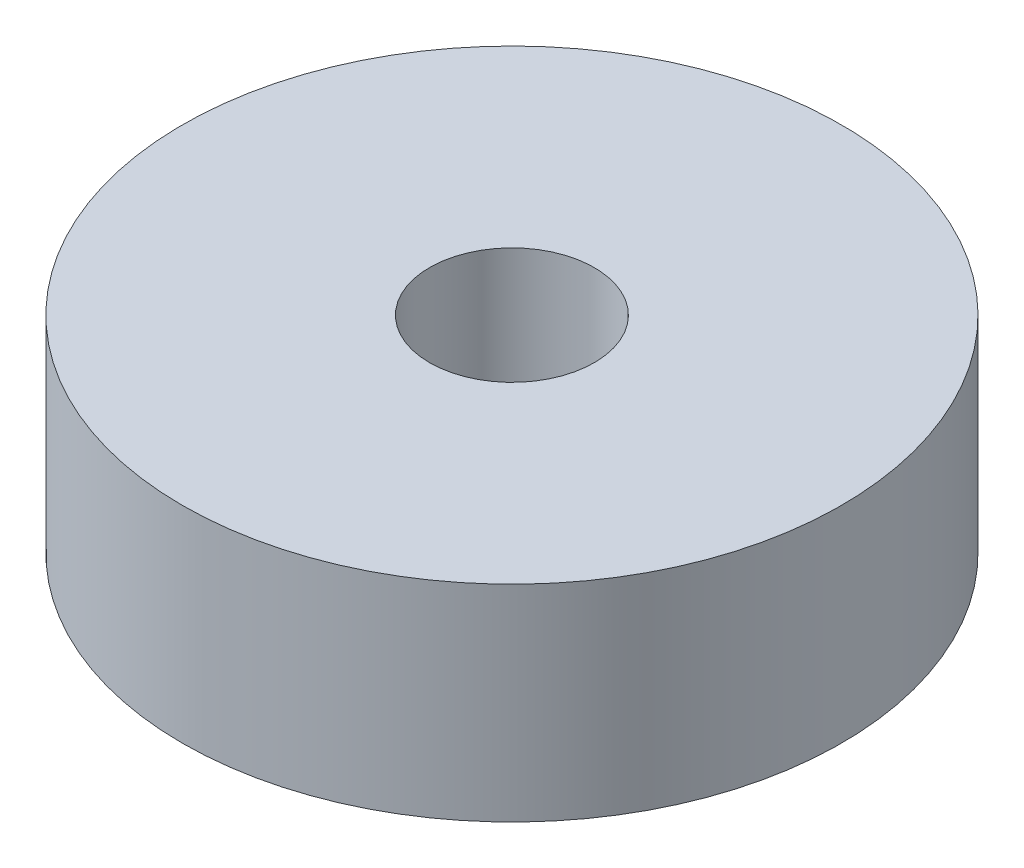
ISO-10303-21;
HEADER;
FILE_DESCRIPTION(('STEP AP214'),'2;1');
FILE_NAME('part.step','',(''),(''),'','','');
FILE_SCHEMA(('AUTOMOTIVE_DESIGN { 1 0 10303 214 1 1 1 1 }'));
ENDSEC;
DATA;
#1=APPLICATION_CONTEXT('core data for automotive mechanical design processes');
#2=APPLICATION_PROTOCOL_DEFINITION('international standard','automotive_design',2000,#1);
#3=PRODUCT_CONTEXT('',#1,'mechanical');
#4=PRODUCT('Part','Part','',(#3));
#5=PRODUCT_RELATED_PRODUCT_CATEGORY('part','',(#4));
#6=PRODUCT_DEFINITION_FORMATION('','',#4);
#7=PRODUCT_DEFINITION_CONTEXT('part definition',#1,'design');
#8=PRODUCT_DEFINITION('design','',#6,#7);
#9=PRODUCT_DEFINITION_SHAPE('','',#8);
#10=(LENGTH_UNIT() NAMED_UNIT(*) SI_UNIT(.MILLI.,.METRE.));
#11=(NAMED_UNIT(*) PLANE_ANGLE_UNIT() SI_UNIT($,.RADIAN.));
#12=(NAMED_UNIT(*) SI_UNIT($,.STERADIAN.) SOLID_ANGLE_UNIT());
#13=UNCERTAINTY_MEASURE_WITH_UNIT(LENGTH_MEASURE(1.E-05),#10,'distance_accuracy_value','');
#14=(GEOMETRIC_REPRESENTATION_CONTEXT(3) GLOBAL_UNCERTAINTY_ASSIGNED_CONTEXT((#13)) GLOBAL_UNIT_ASSIGNED_CONTEXT((#10,
#11,#12)) REPRESENTATION_CONTEXT('',''));
#15=CARTESIAN_POINT('',(0.,0.,0.));
#16=DIRECTION('',(0.,0.,1.));
#17=DIRECTION('',(1.,0.,0.));
#18=AXIS2_PLACEMENT_3D('',#15,#16,#17);
#19=CARTESIAN_POINT('',(0.,5.,0.));
#20=DIRECTION('',(0.,1.,0.));
#21=DIRECTION('',(0.,0.,1.));
#22=AXIS2_PLACEMENT_3D('',#19,#20,#21);
#23=PLANE('',#22);
#24=CARTESIAN_POINT('',(0.,5.,0.));
#25=DIRECTION('',(0.,1.,0.));
#26=DIRECTION('',(0.,0.,1.));
#27=AXIS2_PLACEMENT_3D('',#24,#25,#26);
#28=CIRCLE('',#27,8.);
#29=CARTESIAN_POINT('',(0.,5.,8.));
#30=VERTEX_POINT('',#29);
#31=EDGE_CURVE('E10',#30,#30,#28,.T.);
#32=ORIENTED_EDGE('',*,*,#31,.T.);
#33=EDGE_LOOP('',(#32));
#34=FACE_BOUND('',#33,.T.);
#35=CARTESIAN_POINT('',(0.,5.,0.));
#36=DIRECTION('',(0.,1.,0.));
#37=DIRECTION('',(0.,0.,1.));
#38=AXIS2_PLACEMENT_3D('',#35,#36,#37);
#39=CIRCLE('',#38,2.);
#40=CARTESIAN_POINT('',(0.,5.,2.));
#41=VERTEX_POINT('',#40);
#42=EDGE_CURVE('E43',#41,#41,#39,.T.);
#43=ORIENTED_EDGE('',*,*,#42,.F.);
#44=EDGE_LOOP('',(#43));
#45=FACE_BOUND('',#44,.T.);
#46=ADVANCED_FACE('F32',(#34,#45),#23,.T.);
#47=CARTESIAN_POINT('',(0.,0.,0.));
#48=DIRECTION('',(0.,1.,0.));
#49=DIRECTION('',(0.,0.,1.));
#50=AXIS2_PLACEMENT_3D('',#47,#48,#49);
#51=PLANE('',#50);
#52=CARTESIAN_POINT('',(0.,0.,0.));
#53=DIRECTION('',(0.,1.,0.));
#54=DIRECTION('',(0.,0.,1.));
#55=AXIS2_PLACEMENT_3D('',#52,#53,#54);
#56=CIRCLE('',#55,8.);
#57=CARTESIAN_POINT('',(0.,0.,8.));
#58=VERTEX_POINT('',#57);
#59=EDGE_CURVE('E36',#58,#58,#56,.T.);
#60=ORIENTED_EDGE('',*,*,#59,.F.);
#61=EDGE_LOOP('',(#60));
#62=FACE_BOUND('',#61,.T.);
#63=CARTESIAN_POINT('',(0.,0.,0.));
#64=DIRECTION('',(0.,1.,0.));
#65=DIRECTION('',(0.,0.,1.));
#66=AXIS2_PLACEMENT_3D('',#63,#64,#65);
#67=CIRCLE('',#66,2.);
#68=CARTESIAN_POINT('',(0.,0.,2.));
#69=VERTEX_POINT('',#68);
#70=EDGE_CURVE('E45',#69,#69,#67,.T.);
#71=ORIENTED_EDGE('',*,*,#70,.T.);
#72=EDGE_LOOP('',(#71));
#73=FACE_BOUND('',#72,.T.);
#74=ADVANCED_FACE('F55',(#62,#73),#51,.F.);
#75=CARTESIAN_POINT('',(0.,5.,0.));
#76=DIRECTION('',(0.,-1.,0.));
#77=DIRECTION('',(0.,0.,-1.));
#78=AXIS2_PLACEMENT_3D('',#75,#76,#77);
#79=CYLINDRICAL_SURFACE('',#78,8.);
#80=ORIENTED_EDGE('',*,*,#31,.F.);
#81=EDGE_LOOP('',(#80));
#82=FACE_BOUND('',#81,.T.);
#83=ORIENTED_EDGE('',*,*,#59,.T.);
#84=EDGE_LOOP('',(#83));
#85=FACE_BOUND('',#84,.T.);
#86=ADVANCED_FACE('F34',(#82,#85),#79,.T.);
#87=CARTESIAN_POINT('',(0.,5.,0.));
#88=DIRECTION('',(0.,-1.,0.));
#89=DIRECTION('',(0.,0.,-1.));
#90=AXIS2_PLACEMENT_3D('',#87,#88,#89);
#91=CYLINDRICAL_SURFACE('',#90,2.);
#92=ORIENTED_EDGE('',*,*,#42,.T.);
#93=EDGE_LOOP('',(#92));
#94=FACE_BOUND('',#93,.T.);
#95=ORIENTED_EDGE('',*,*,#70,.F.);
#96=EDGE_LOOP('',(#95));
#97=FACE_BOUND('',#96,.T.);
#98=ADVANCED_FACE('F51',(#94,#97),#91,.F.);
#99=CLOSED_SHELL('',(#46,#74,#86,#98));
#100=MANIFOLD_SOLID_BREP('B2',#99);
#101=ADVANCED_BREP_SHAPE_REPRESENTATION('',(#18,#100),#14);
#102=SHAPE_DEFINITION_REPRESENTATION(#9,#101);
ENDSEC;
END-ISO-10303-21;
